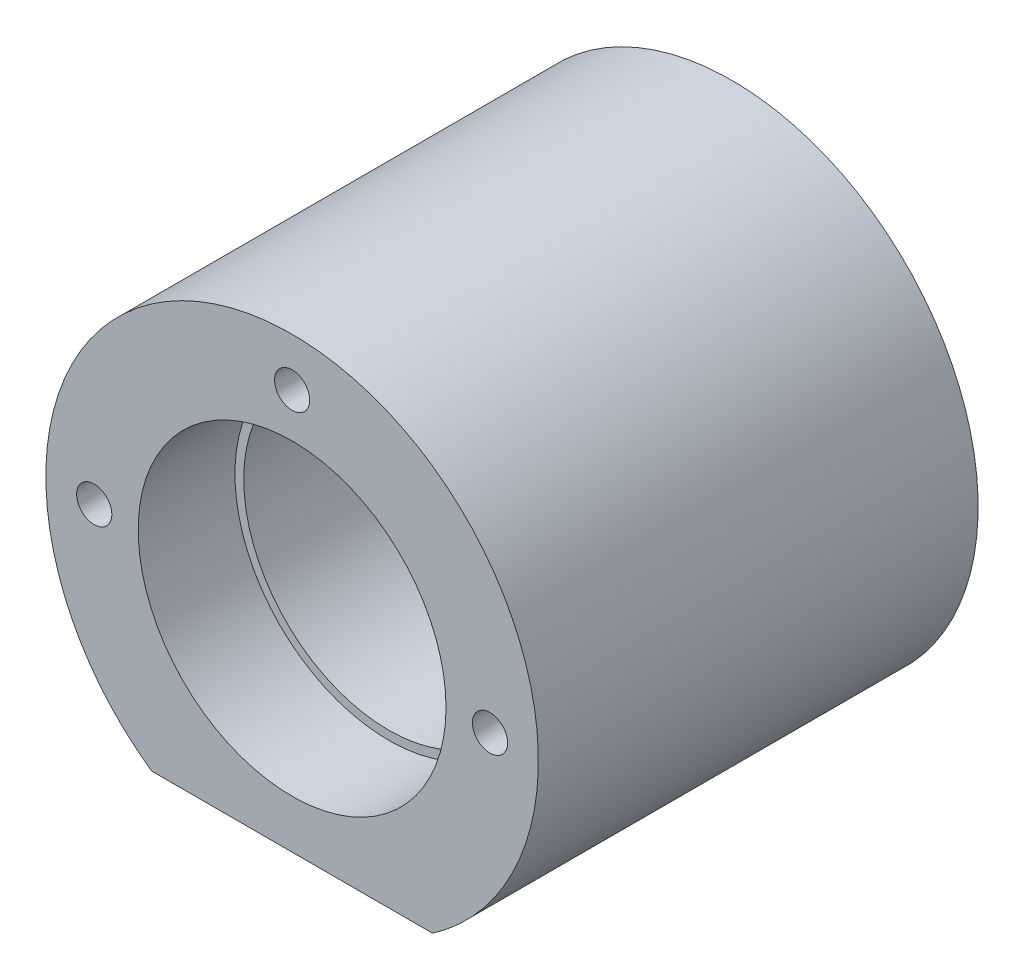
ISO-10303-21;
HEADER;
FILE_DESCRIPTION(('STEP AP214'),'2;1');
FILE_NAME('part.step','',(''),(''),'','','');
FILE_SCHEMA(('AUTOMOTIVE_DESIGN { 1 0 10303 214 1 1 1 1 }'));
ENDSEC;
DATA;
#1=APPLICATION_CONTEXT('core data for automotive mechanical design processes');
#2=APPLICATION_PROTOCOL_DEFINITION('international standard','automotive_design',2000,#1);
#3=PRODUCT_CONTEXT('',#1,'mechanical');
#4=PRODUCT('Part','Part','',(#3));
#5=PRODUCT_RELATED_PRODUCT_CATEGORY('part','',(#4));
#6=PRODUCT_DEFINITION_FORMATION('','',#4);
#7=PRODUCT_DEFINITION_CONTEXT('part definition',#1,'design');
#8=PRODUCT_DEFINITION('design','',#6,#7);
#9=PRODUCT_DEFINITION_SHAPE('','',#8);
#10=(LENGTH_UNIT() NAMED_UNIT(*) SI_UNIT(.MILLI.,.METRE.));
#11=(NAMED_UNIT(*) PLANE_ANGLE_UNIT() SI_UNIT($,.RADIAN.));
#12=(NAMED_UNIT(*) SI_UNIT($,.STERADIAN.) SOLID_ANGLE_UNIT());
#13=UNCERTAINTY_MEASURE_WITH_UNIT(LENGTH_MEASURE(1.E-05),#10,'distance_accuracy_value','');
#14=(GEOMETRIC_REPRESENTATION_CONTEXT(3) GLOBAL_UNCERTAINTY_ASSIGNED_CONTEXT((#13)) GLOBAL_UNIT_ASSIGNED_CONTEXT((#10,
#11,#12)) REPRESENTATION_CONTEXT('',''));
#15=CARTESIAN_POINT('',(0.,0.,0.));
#16=DIRECTION('',(0.,0.,1.));
#17=DIRECTION('',(1.,0.,0.));
#18=AXIS2_PLACEMENT_3D('',#15,#16,#17);
#19=CARTESIAN_POINT('',(0.,23.,50.));
#20=DIRECTION('',(0.,0.,-1.));
#21=DIRECTION('',(-1.,0.,0.));
#22=AXIS2_PLACEMENT_3D('',#19,#20,#21);
#23=CYLINDRICAL_SURFACE('',#22,16.5);
#24=CARTESIAN_POINT('',(0.,23.,39.));
#25=DIRECTION('',(0.,0.,1.));
#26=DIRECTION('',(1.,0.,0.));
#27=AXIS2_PLACEMENT_3D('',#24,#25,#26);
#28=CIRCLE('',#27,16.5);
#29=CARTESIAN_POINT('',(16.5,23.,39.));
#30=VERTEX_POINT('',#29);
#31=EDGE_CURVE('E74',#30,#30,#28,.T.);
#32=ORIENTED_EDGE('',*,*,#31,.T.);
#33=EDGE_LOOP('',(#32));
#34=FACE_BOUND('',#33,.T.);
#35=CARTESIAN_POINT('',(0.,23.,11.));
#36=DIRECTION('',(0.,0.,-1.));
#37=DIRECTION('',(-1.,0.,0.));
#38=AXIS2_PLACEMENT_3D('',#35,#36,#37);
#39=CIRCLE('',#38,16.5);
#40=CARTESIAN_POINT('',(-16.5,23.,11.));
#41=VERTEX_POINT('',#40);
#42=EDGE_CURVE('E39',#41,#41,#39,.T.);
#43=ORIENTED_EDGE('',*,*,#42,.T.);
#44=EDGE_LOOP('',(#43));
#45=FACE_BOUND('',#44,.T.);
#46=ADVANCED_FACE('F35',(#34,#45),#23,.F.);
#47=CARTESIAN_POINT('',(0.,23.,50.));
#48=DIRECTION('',(0.,0.,1.));
#49=DIRECTION('',(1.,0.,0.));
#50=AXIS2_PLACEMENT_3D('',#47,#48,#49);
#51=PLANE('',#50);
#52=CARTESIAN_POINT('',(0.,45.5,50.));
#53=DIRECTION('',(0.,0.,-1.));
#54=DIRECTION('',(-1.,0.,0.));
#55=AXIS2_PLACEMENT_3D('',#52,#53,#54);
#56=CIRCLE('',#55,2.);
#57=CARTESIAN_POINT('',(-2.,45.5,50.));
#58=VERTEX_POINT('',#57);
#59=EDGE_CURVE('E123',#58,#58,#56,.T.);
#60=ORIENTED_EDGE('',*,*,#59,.T.);
#61=EDGE_LOOP('',(#60));
#62=FACE_BOUND('',#61,.T.);
#63=CARTESIAN_POINT('',(22.5,23.,50.));
#64=DIRECTION('',(0.,0.,-1.));
#65=DIRECTION('',(-1.,0.,0.));
#66=AXIS2_PLACEMENT_3D('',#63,#64,#65);
#67=CIRCLE('',#66,2.);
#68=CARTESIAN_POINT('',(20.5,23.,50.));
#69=VERTEX_POINT('',#68);
#70=EDGE_CURVE('E117',#69,#69,#67,.T.);
#71=ORIENTED_EDGE('',*,*,#70,.T.);
#72=EDGE_LOOP('',(#71));
#73=FACE_BOUND('',#72,.T.);
#74=CARTESIAN_POINT('',(-22.5,23.,50.));
#75=DIRECTION('',(0.,0.,-1.));
#76=DIRECTION('',(-1.,0.,0.));
#77=AXIS2_PLACEMENT_3D('',#74,#75,#76);
#78=CIRCLE('',#77,2.);
#79=CARTESIAN_POINT('',(-24.5,23.,50.));
#80=VERTEX_POINT('',#79);
#81=EDGE_CURVE('E111',#80,#80,#78,.T.);
#82=ORIENTED_EDGE('',*,*,#81,.T.);
#83=EDGE_LOOP('',(#82));
#84=FACE_BOUND('',#83,.T.);
#85=CARTESIAN_POINT('',(0.,23.,50.));
#86=DIRECTION('',(0.,0.,1.));
#87=DIRECTION('',(1.,0.,0.));
#88=AXIS2_PLACEMENT_3D('',#85,#86,#87);
#89=CIRCLE('',#88,17.5);
#90=CARTESIAN_POINT('',(17.5,23.,50.));
#91=VERTEX_POINT('',#90);
#92=EDGE_CURVE('E81',#91,#91,#89,.T.);
#93=ORIENTED_EDGE('',*,*,#92,.F.);
#94=EDGE_LOOP('',(#93));
#95=FACE_BOUND('',#94,.T.);
#96=CARTESIAN_POINT('',(0.,23.,50.));
#97=DIRECTION('',(0.,0.,1.));
#98=DIRECTION('',(1.,0.,0.));
#99=AXIS2_PLACEMENT_3D('',#96,#97,#98);
#100=CIRCLE('',#99,28.);
#101=CARTESIAN_POINT('',(15.9687194226713,0.,50.));
#102=VERTEX_POINT('',#101);
#103=CARTESIAN_POINT('',(-15.9687194226713,0.,50.));
#104=VERTEX_POINT('',#103);
#105=EDGE_CURVE('E68',#102,#104,#100,.T.);
#106=ORIENTED_EDGE('',*,*,#105,.T.);
#107=DIRECTION('',(1.,0.,0.));
#108=VECTOR('',#107,1.);
#109=CARTESIAN_POINT('',(-15.9687194226713,0.,50.));
#110=LINE('',#109,#108);
#111=EDGE_CURVE('E53',#104,#102,#110,.T.);
#112=ORIENTED_EDGE('',*,*,#111,.T.);
#113=EDGE_LOOP('',(#106,#112));
#114=FACE_BOUND('',#113,.T.);
#115=ADVANCED_FACE('F141',(#62,#73,#84,#95,#114),#51,.T.);
#116=CARTESIAN_POINT('',(0.,23.,0.));
#117=DIRECTION('',(0.,0.,1.));
#118=DIRECTION('',(1.,0.,0.));
#119=AXIS2_PLACEMENT_3D('',#116,#117,#118);
#120=PLANE('',#119);
#121=CARTESIAN_POINT('',(0.,45.5,0.));
#122=DIRECTION('',(0.,0.,-1.));
#123=DIRECTION('',(-1.,0.,0.));
#124=AXIS2_PLACEMENT_3D('',#121,#122,#123);
#125=CIRCLE('',#124,2.);
#126=CARTESIAN_POINT('',(-2.,45.5,0.));
#127=VERTEX_POINT('',#126);
#128=EDGE_CURVE('E106',#127,#127,#125,.T.);
#129=ORIENTED_EDGE('',*,*,#128,.F.);
#130=EDGE_LOOP('',(#129));
#131=FACE_BOUND('',#130,.T.);
#132=CARTESIAN_POINT('',(22.5,23.,0.));
#133=DIRECTION('',(0.,0.,-1.));
#134=DIRECTION('',(-1.,0.,0.));
#135=AXIS2_PLACEMENT_3D('',#132,#133,#134);
#136=CIRCLE('',#135,2.);
#137=CARTESIAN_POINT('',(20.5,23.,0.));
#138=VERTEX_POINT('',#137);
#139=EDGE_CURVE('E100',#138,#138,#136,.T.);
#140=ORIENTED_EDGE('',*,*,#139,.F.);
#141=EDGE_LOOP('',(#140));
#142=FACE_BOUND('',#141,.T.);
#143=CARTESIAN_POINT('',(-22.5,23.,0.));
#144=DIRECTION('',(0.,0.,-1.));
#145=DIRECTION('',(-1.,0.,0.));
#146=AXIS2_PLACEMENT_3D('',#143,#144,#145);
#147=CIRCLE('',#146,2.);
#148=CARTESIAN_POINT('',(-24.5,23.,0.));
#149=VERTEX_POINT('',#148);
#150=EDGE_CURVE('E93',#149,#149,#147,.T.);
#151=ORIENTED_EDGE('',*,*,#150,.F.);
#152=EDGE_LOOP('',(#151));
#153=FACE_BOUND('',#152,.T.);
#154=CARTESIAN_POINT('',(0.,23.,0.));
#155=DIRECTION('',(0.,0.,1.));
#156=DIRECTION('',(1.,0.,0.));
#157=AXIS2_PLACEMENT_3D('',#154,#155,#156);
#158=CIRCLE('',#157,17.5);
#159=CARTESIAN_POINT('',(17.5,23.,0.));
#160=VERTEX_POINT('',#159);
#161=EDGE_CURVE('E86',#160,#160,#158,.T.);
#162=ORIENTED_EDGE('',*,*,#161,.T.);
#163=EDGE_LOOP('',(#162));
#164=FACE_BOUND('',#163,.T.);
#165=CARTESIAN_POINT('',(0.,23.,0.));
#166=DIRECTION('',(0.,0.,1.));
#167=DIRECTION('',(1.,0.,0.));
#168=AXIS2_PLACEMENT_3D('',#165,#166,#167);
#169=CIRCLE('',#168,28.);
#170=CARTESIAN_POINT('',(15.9687194226713,0.,0.));
#171=VERTEX_POINT('',#170);
#172=CARTESIAN_POINT('',(-15.9687194226713,0.,0.));
#173=VERTEX_POINT('',#172);
#174=EDGE_CURVE('E69',#171,#173,#169,.T.);
#175=ORIENTED_EDGE('',*,*,#174,.F.);
#176=DIRECTION('',(1.,0.,0.));
#177=VECTOR('',#176,1.);
#178=CARTESIAN_POINT('',(-15.9687194226713,0.,0.));
#179=LINE('',#178,#177);
#180=EDGE_CURVE('E61',#173,#171,#179,.T.);
#181=ORIENTED_EDGE('',*,*,#180,.F.);
#182=EDGE_LOOP('',(#175,#181));
#183=FACE_BOUND('',#182,.T.);
#184=ADVANCED_FACE('F73',(#131,#142,#153,#164,#183),#120,.F.);
#185=CARTESIAN_POINT('',(0.,23.,50.));
#186=DIRECTION('',(0.,0.,-1.));
#187=DIRECTION('',(-1.,0.,0.));
#188=AXIS2_PLACEMENT_3D('',#185,#186,#187);
#189=CYLINDRICAL_SURFACE('',#188,28.);
#190=ORIENTED_EDGE('',*,*,#174,.T.);
#191=DIRECTION('',(0.,0.,-1.));
#192=VECTOR('',#191,1.);
#193=CARTESIAN_POINT('',(-15.9687194226713,0.,50.));
#194=LINE('',#193,#192);
#195=EDGE_CURVE('E11',#104,#173,#194,.T.);
#196=ORIENTED_EDGE('',*,*,#195,.F.);
#197=ORIENTED_EDGE('',*,*,#105,.F.);
#198=DIRECTION('',(0.,0.,-1.));
#199=VECTOR('',#198,1.);
#200=CARTESIAN_POINT('',(15.9687194226713,0.,50.));
#201=LINE('',#200,#199);
#202=EDGE_CURVE('E45',#102,#171,#201,.T.);
#203=ORIENTED_EDGE('',*,*,#202,.T.);
#204=EDGE_LOOP('',(#190,#196,#197,#203));
#205=FACE_BOUND('',#204,.T.);
#206=ADVANCED_FACE('F37',(#205),#189,.T.);
#207=CARTESIAN_POINT('',(-15.9687194226713,0.,50.));
#208=DIRECTION('',(0.,1.,0.));
#209=DIRECTION('',(0.,0.,1.));
#210=AXIS2_PLACEMENT_3D('',#207,#208,#209);
#211=PLANE('',#210);
#212=ORIENTED_EDGE('',*,*,#180,.T.);
#213=ORIENTED_EDGE('',*,*,#202,.F.);
#214=ORIENTED_EDGE('',*,*,#111,.F.);
#215=ORIENTED_EDGE('',*,*,#195,.T.);
#216=EDGE_LOOP('',(#212,#213,#214,#215));
#217=FACE_BOUND('',#216,.T.);
#218=ADVANCED_FACE('F64',(#217),#211,.F.);
#219=CARTESIAN_POINT('',(0.,23.,39.));
#220=DIRECTION('',(0.,0.,1.));
#221=DIRECTION('',(1.,0.,0.));
#222=AXIS2_PLACEMENT_3D('',#219,#220,#221);
#223=CYLINDRICAL_SURFACE('',#222,17.5);
#224=CARTESIAN_POINT('',(0.,23.,39.));
#225=DIRECTION('',(0.,0.,1.));
#226=DIRECTION('',(1.,0.,0.));
#227=AXIS2_PLACEMENT_3D('',#224,#225,#226);
#228=CIRCLE('',#227,17.5);
#229=CARTESIAN_POINT('',(17.5,23.,39.));
#230=VERTEX_POINT('',#229);
#231=EDGE_CURVE('E77',#230,#230,#228,.T.);
#232=ORIENTED_EDGE('',*,*,#231,.F.);
#233=EDGE_LOOP('',(#232));
#234=FACE_BOUND('',#233,.T.);
#235=ORIENTED_EDGE('',*,*,#92,.T.);
#236=EDGE_LOOP('',(#235));
#237=FACE_BOUND('',#236,.T.);
#238=ADVANCED_FACE('F151',(#234,#237),#223,.F.);
#239=CARTESIAN_POINT('',(0.,23.,39.));
#240=DIRECTION('',(0.,0.,1.));
#241=DIRECTION('',(1.,0.,0.));
#242=AXIS2_PLACEMENT_3D('',#239,#240,#241);
#243=PLANE('',#242);
#244=ORIENTED_EDGE('',*,*,#31,.F.);
#245=EDGE_LOOP('',(#244));
#246=FACE_BOUND('',#245,.T.);
#247=ORIENTED_EDGE('',*,*,#231,.T.);
#248=EDGE_LOOP('',(#247));
#249=FACE_BOUND('',#248,.T.);
#250=ADVANCED_FACE('F161',(#246,#249),#243,.T.);
#251=CARTESIAN_POINT('',(0.,23.,11.));
#252=DIRECTION('',(0.,0.,-1.));
#253=DIRECTION('',(-1.,0.,0.));
#254=AXIS2_PLACEMENT_3D('',#251,#252,#253);
#255=CYLINDRICAL_SURFACE('',#254,17.5);
#256=CARTESIAN_POINT('',(0.,23.,11.));
#257=DIRECTION('',(0.,0.,1.));
#258=DIRECTION('',(1.,0.,0.));
#259=AXIS2_PLACEMENT_3D('',#256,#257,#258);
#260=CIRCLE('',#259,17.5);
#261=CARTESIAN_POINT('',(17.5,23.,11.));
#262=VERTEX_POINT('',#261);
#263=EDGE_CURVE('E89',#262,#262,#260,.T.);
#264=ORIENTED_EDGE('',*,*,#263,.T.);
#265=EDGE_LOOP('',(#264));
#266=FACE_BOUND('',#265,.T.);
#267=ORIENTED_EDGE('',*,*,#161,.F.);
#268=EDGE_LOOP('',(#267));
#269=FACE_BOUND('',#268,.T.);
#270=ADVANCED_FACE('F261',(#266,#269),#255,.F.);
#271=CARTESIAN_POINT('',(0.,23.,11.));
#272=DIRECTION('',(0.,0.,-1.));
#273=DIRECTION('',(1.,0.,0.));
#274=AXIS2_PLACEMENT_3D('',#271,#272,#273);
#275=PLANE('',#274);
#276=ORIENTED_EDGE('',*,*,#42,.F.);
#277=EDGE_LOOP('',(#276));
#278=FACE_BOUND('',#277,.T.);
#279=ORIENTED_EDGE('',*,*,#263,.F.);
#280=EDGE_LOOP('',(#279));
#281=FACE_BOUND('',#280,.T.);
#282=ADVANCED_FACE('F257',(#278,#281),#275,.T.);
#283=CARTESIAN_POINT('',(-22.5,23.,10.));
#284=DIRECTION('',(0.,0.,-1.));
#285=DIRECTION('',(-1.,0.,0.));
#286=AXIS2_PLACEMENT_3D('',#283,#284,#285);
#287=CYLINDRICAL_SURFACE('',#286,2.);
#288=CARTESIAN_POINT('',(-22.5,23.,10.));
#289=DIRECTION('',(0.,0.,-1.));
#290=DIRECTION('',(-1.,0.,0.));
#291=AXIS2_PLACEMENT_3D('',#288,#289,#290);
#292=CIRCLE('',#291,2.);
#293=CARTESIAN_POINT('',(-24.5,23.,10.));
#294=VERTEX_POINT('',#293);
#295=EDGE_CURVE('E96',#294,#294,#292,.T.);
#296=ORIENTED_EDGE('',*,*,#295,.F.);
#297=EDGE_LOOP('',(#296));
#298=FACE_BOUND('',#297,.T.);
#299=ORIENTED_EDGE('',*,*,#150,.T.);
#300=EDGE_LOOP('',(#299));
#301=FACE_BOUND('',#300,.T.);
#302=ADVANCED_FACE('F253',(#298,#301),#287,.F.);
#303=CARTESIAN_POINT('',(-22.5,23.,10.));
#304=DIRECTION('',(0.,0.,-1.));
#305=DIRECTION('',(-1.,0.,0.));
#306=AXIS2_PLACEMENT_3D('',#303,#304,#305);
#307=PLANE('',#306);
#308=ORIENTED_EDGE('',*,*,#295,.T.);
#309=EDGE_LOOP('',(#308));
#310=FACE_BOUND('',#309,.T.);
#311=ADVANCED_FACE('F249',(#310),#307,.T.);
#312=CARTESIAN_POINT('',(22.5,23.,10.));
#313=DIRECTION('',(0.,0.,-1.));
#314=DIRECTION('',(-1.,0.,0.));
#315=AXIS2_PLACEMENT_3D('',#312,#313,#314);
#316=CYLINDRICAL_SURFACE('',#315,2.);
#317=CARTESIAN_POINT('',(22.5,23.,10.));
#318=DIRECTION('',(0.,0.,-1.));
#319=DIRECTION('',(-1.,0.,0.));
#320=AXIS2_PLACEMENT_3D('',#317,#318,#319);
#321=CIRCLE('',#320,2.);
#322=CARTESIAN_POINT('',(20.5,23.,10.));
#323=VERTEX_POINT('',#322);
#324=EDGE_CURVE('E103',#323,#323,#321,.T.);
#325=ORIENTED_EDGE('',*,*,#324,.F.);
#326=EDGE_LOOP('',(#325));
#327=FACE_BOUND('',#326,.T.);
#328=ORIENTED_EDGE('',*,*,#139,.T.);
#329=EDGE_LOOP('',(#328));
#330=FACE_BOUND('',#329,.T.);
#331=ADVANCED_FACE('F245',(#327,#330),#316,.F.);
#332=CARTESIAN_POINT('',(22.5,23.,10.));
#333=DIRECTION('',(0.,0.,-1.));
#334=DIRECTION('',(-1.,0.,0.));
#335=AXIS2_PLACEMENT_3D('',#332,#333,#334);
#336=PLANE('',#335);
#337=ORIENTED_EDGE('',*,*,#324,.T.);
#338=EDGE_LOOP('',(#337));
#339=FACE_BOUND('',#338,.T.);
#340=ADVANCED_FACE('F241',(#339),#336,.T.);
#341=CARTESIAN_POINT('',(0.,45.5,10.));
#342=DIRECTION('',(0.,0.,-1.));
#343=DIRECTION('',(-1.,0.,0.));
#344=AXIS2_PLACEMENT_3D('',#341,#342,#343);
#345=CYLINDRICAL_SURFACE('',#344,2.);
#346=CARTESIAN_POINT('',(0.,45.5,10.));
#347=DIRECTION('',(0.,0.,-1.));
#348=DIRECTION('',(-1.,0.,0.));
#349=AXIS2_PLACEMENT_3D('',#346,#347,#348);
#350=CIRCLE('',#349,2.);
#351=CARTESIAN_POINT('',(-2.,45.5,10.));
#352=VERTEX_POINT('',#351);
#353=EDGE_CURVE('E90',#352,#352,#350,.T.);
#354=ORIENTED_EDGE('',*,*,#353,.F.);
#355=EDGE_LOOP('',(#354));
#356=FACE_BOUND('',#355,.T.);
#357=ORIENTED_EDGE('',*,*,#128,.T.);
#358=EDGE_LOOP('',(#357));
#359=FACE_BOUND('',#358,.T.);
#360=ADVANCED_FACE('F237',(#356,#359),#345,.F.);
#361=CARTESIAN_POINT('',(0.,45.5,10.));
#362=DIRECTION('',(0.,0.,-1.));
#363=DIRECTION('',(-1.,0.,0.));
#364=AXIS2_PLACEMENT_3D('',#361,#362,#363);
#365=PLANE('',#364);
#366=ORIENTED_EDGE('',*,*,#353,.T.);
#367=EDGE_LOOP('',(#366));
#368=FACE_BOUND('',#367,.T.);
#369=ADVANCED_FACE('F181',(#368),#365,.T.);
#370=CARTESIAN_POINT('',(-22.5,23.,40.));
#371=DIRECTION('',(0.,0.,1.));
#372=DIRECTION('',(1.,0.,0.));
#373=AXIS2_PLACEMENT_3D('',#370,#371,#372);
#374=CYLINDRICAL_SURFACE('',#373,2.);
#375=CARTESIAN_POINT('',(-22.5,23.,40.));
#376=DIRECTION('',(0.,0.,-1.));
#377=DIRECTION('',(-1.,0.,0.));
#378=AXIS2_PLACEMENT_3D('',#375,#376,#377);
#379=CIRCLE('',#378,2.);
#380=CARTESIAN_POINT('',(-24.5,23.,40.));
#381=VERTEX_POINT('',#380);
#382=EDGE_CURVE('E114',#381,#381,#379,.T.);
#383=ORIENTED_EDGE('',*,*,#382,.T.);
#384=EDGE_LOOP('',(#383));
#385=FACE_BOUND('',#384,.T.);
#386=ORIENTED_EDGE('',*,*,#81,.F.);
#387=EDGE_LOOP('',(#386));
#388=FACE_BOUND('',#387,.T.);
#389=ADVANCED_FACE('F186',(#385,#388),#374,.F.);
#390=CARTESIAN_POINT('',(-22.5,23.,40.));
#391=DIRECTION('',(0.,0.,1.));
#392=DIRECTION('',(-1.,0.,0.));
#393=AXIS2_PLACEMENT_3D('',#390,#391,#392);
#394=PLANE('',#393);
#395=ORIENTED_EDGE('',*,*,#382,.F.);
#396=EDGE_LOOP('',(#395));
#397=FACE_BOUND('',#396,.T.);
#398=ADVANCED_FACE('F191',(#397),#394,.T.);
#399=CARTESIAN_POINT('',(22.5,23.,40.));
#400=DIRECTION('',(0.,0.,1.));
#401=DIRECTION('',(1.,0.,0.));
#402=AXIS2_PLACEMENT_3D('',#399,#400,#401);
#403=CYLINDRICAL_SURFACE('',#402,2.);
#404=CARTESIAN_POINT('',(22.5,23.,40.));
#405=DIRECTION('',(0.,0.,-1.));
#406=DIRECTION('',(-1.,0.,0.));
#407=AXIS2_PLACEMENT_3D('',#404,#405,#406);
#408=CIRCLE('',#407,2.);
#409=CARTESIAN_POINT('',(20.5,23.,40.));
#410=VERTEX_POINT('',#409);
#411=EDGE_CURVE('E120',#410,#410,#408,.T.);
#412=ORIENTED_EDGE('',*,*,#411,.T.);
#413=EDGE_LOOP('',(#412));
#414=FACE_BOUND('',#413,.T.);
#415=ORIENTED_EDGE('',*,*,#70,.F.);
#416=EDGE_LOOP('',(#415));
#417=FACE_BOUND('',#416,.T.);
#418=ADVANCED_FACE('F201',(#414,#417),#403,.F.);
#419=CARTESIAN_POINT('',(22.5,23.,40.));
#420=DIRECTION('',(0.,0.,1.));
#421=DIRECTION('',(-1.,0.,0.));
#422=AXIS2_PLACEMENT_3D('',#419,#420,#421);
#423=PLANE('',#422);
#424=ORIENTED_EDGE('',*,*,#411,.F.);
#425=EDGE_LOOP('',(#424));
#426=FACE_BOUND('',#425,.T.);
#427=ADVANCED_FACE('F138',(#426),#423,.T.);
#428=CARTESIAN_POINT('',(0.,45.5,40.));
#429=DIRECTION('',(0.,0.,1.));
#430=DIRECTION('',(1.,0.,0.));
#431=AXIS2_PLACEMENT_3D('',#428,#429,#430);
#432=CYLINDRICAL_SURFACE('',#431,2.);
#433=CARTESIAN_POINT('',(0.,45.5,40.));
#434=DIRECTION('',(0.,0.,-1.));
#435=DIRECTION('',(-1.,0.,0.));
#436=AXIS2_PLACEMENT_3D('',#433,#434,#435);
#437=CIRCLE('',#436,2.);
#438=CARTESIAN_POINT('',(-2.,45.5,40.));
#439=VERTEX_POINT('',#438);
#440=EDGE_CURVE('E97',#439,#439,#437,.T.);
#441=ORIENTED_EDGE('',*,*,#440,.T.);
#442=EDGE_LOOP('',(#441));
#443=FACE_BOUND('',#442,.T.);
#444=ORIENTED_EDGE('',*,*,#59,.F.);
#445=EDGE_LOOP('',(#444));
#446=FACE_BOUND('',#445,.T.);
#447=ADVANCED_FACE('F129',(#443,#446),#432,.F.);
#448=CARTESIAN_POINT('',(0.,45.5,40.));
#449=DIRECTION('',(0.,0.,1.));
#450=DIRECTION('',(-1.,0.,0.));
#451=AXIS2_PLACEMENT_3D('',#448,#449,#450);
#452=PLANE('',#451);
#453=ORIENTED_EDGE('',*,*,#440,.F.);
#454=EDGE_LOOP('',(#453));
#455=FACE_BOUND('',#454,.T.);
#456=ADVANCED_FACE('F132',(#455),#452,.T.);
#457=CLOSED_SHELL('',(#46,#115,#184,#206,#218,#238,#250,#270,#282,#302,#311,#331,#340,#360,#369,
#389,#398,#418,#427,#447,#456));
#458=MANIFOLD_SOLID_BREP('B2',#457);
#459=ADVANCED_BREP_SHAPE_REPRESENTATION('',(#18,#458),#14);
#460=SHAPE_DEFINITION_REPRESENTATION(#9,#459);
ENDSEC;
END-ISO-10303-21;
